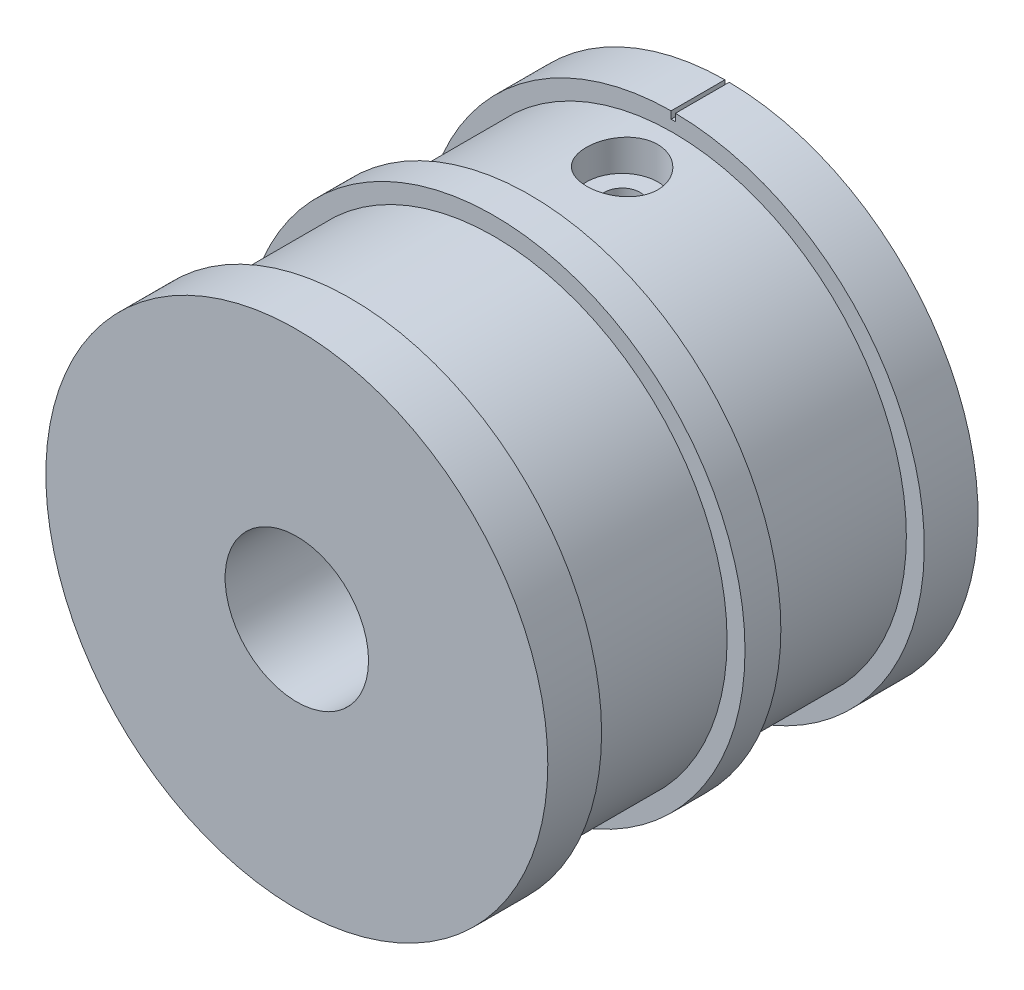
ISO-10303-21;
HEADER;
FILE_DESCRIPTION(('STEP AP214'),'2;1');
FILE_NAME('part.step','',(''),(''),'','','');
FILE_SCHEMA(('AUTOMOTIVE_DESIGN { 1 0 10303 214 1 1 1 1 }'));
ENDSEC;
DATA;
#1=APPLICATION_CONTEXT('core data for automotive mechanical design processes');
#2=APPLICATION_PROTOCOL_DEFINITION('international standard','automotive_design',2000,#1);
#3=PRODUCT_CONTEXT('',#1,'mechanical');
#4=PRODUCT('Part','Part','',(#3));
#5=PRODUCT_RELATED_PRODUCT_CATEGORY('part','',(#4));
#6=PRODUCT_DEFINITION_FORMATION('','',#4);
#7=PRODUCT_DEFINITION_CONTEXT('part definition',#1,'design');
#8=PRODUCT_DEFINITION('design','',#6,#7);
#9=PRODUCT_DEFINITION_SHAPE('','',#8);
#10=(LENGTH_UNIT() NAMED_UNIT(*) SI_UNIT(.MILLI.,.METRE.));
#11=(NAMED_UNIT(*) PLANE_ANGLE_UNIT() SI_UNIT($,.RADIAN.));
#12=(NAMED_UNIT(*) SI_UNIT($,.STERADIAN.) SOLID_ANGLE_UNIT());
#13=UNCERTAINTY_MEASURE_WITH_UNIT(LENGTH_MEASURE(1.E-05),#10,'distance_accuracy_value','');
#14=(GEOMETRIC_REPRESENTATION_CONTEXT(3) GLOBAL_UNCERTAINTY_ASSIGNED_CONTEXT((#13)) GLOBAL_UNIT_ASSIGNED_CONTEXT((#10,
#11,#12)) REPRESENTATION_CONTEXT('',''));
#15=CARTESIAN_POINT('',(0.,0.,0.));
#16=DIRECTION('',(0.,0.,1.));
#17=DIRECTION('',(1.,0.,0.));
#18=AXIS2_PLACEMENT_3D('',#15,#16,#17);
#19=CARTESIAN_POINT('',(0.,0.,27.5));
#20=DIRECTION('',(0.,0.,-1.));
#21=DIRECTION('',(-1.,0.,0.));
#22=AXIS2_PLACEMENT_3D('',#19,#20,#21);
#23=CYLINDRICAL_SURFACE('',#22,32.5);
#24=CARTESIAN_POINT('',(0.,0.,7.5));
#25=DIRECTION('',(0.,0.,1.));
#26=DIRECTION('',(1.,0.,0.));
#27=AXIS2_PLACEMENT_3D('',#24,#25,#26);
#28=CIRCLE('',#27,32.5);
#29=CARTESIAN_POINT('',(32.5,0.,7.5));
#30=VERTEX_POINT('',#29);
#31=EDGE_CURVE('E145',#30,#30,#28,.T.);
#32=ORIENTED_EDGE('',*,*,#31,.T.);
#33=EDGE_LOOP('',(#32));
#34=FACE_BOUND('',#33,.T.);
#35=CARTESIAN_POINT('',(0.,0.,27.5));
#36=DIRECTION('',(0.,0.,1.));
#37=DIRECTION('',(1.,0.,0.));
#38=AXIS2_PLACEMENT_3D('',#35,#36,#37);
#39=CIRCLE('',#38,32.5);
#40=CARTESIAN_POINT('',(32.5,0.,27.5));
#41=VERTEX_POINT('',#40);
#42=EDGE_CURVE('E148',#41,#41,#39,.T.);
#43=ORIENTED_EDGE('',*,*,#42,.F.);
#44=EDGE_LOOP('',(#43));
#45=FACE_BOUND('',#44,.T.);
#46=CARTESIAN_POINT('',(5.3662859612399,32.0539073278469,15.));
#47=CARTESIAN_POINT('',(5.3662879328032,32.0539064748225,14.8605836295942));
#48=CARTESIAN_POINT('',(5.36045293712174,32.0548853571854,14.7211944761494));
#49=CARTESIAN_POINT('',(5.33716061650461,32.0587720354693,14.4433743257646));
#50=CARTESIAN_POINT('',(5.31970087346708,32.0616802327129,14.3049435342313));
#51=CARTESIAN_POINT('',(5.27327373309989,32.0693488326322,14.029986220704));
#52=CARTESIAN_POINT('',(5.2442986163395,32.0741104777387,13.8934610398315));
#53=CARTESIAN_POINT('',(5.17505041226576,32.0853562113026,13.6233254578337));
#54=CARTESIAN_POINT('',(5.13477317409162,32.0918409325372,13.4897161470691));
#55=CARTESIAN_POINT('',(5.04328400598662,32.1063455842766,13.2265651872142));
#56=CARTESIAN_POINT('',(4.9920854181266,32.1143636403562,13.0970187941831));
#57=CARTESIAN_POINT('',(4.87908080684477,32.1317263368553,12.8426740527588));
#58=CARTESIAN_POINT('',(4.81727087445043,32.1410714659176,12.7178774748582));
#59=CARTESIAN_POINT('',(4.68353655572618,32.1608309801898,12.473999597601));
#60=CARTESIAN_POINT('',(4.61161732208519,32.171244819955,12.3549154278598));
#61=CARTESIAN_POINT('',(4.45811997661729,32.1928745737956,12.1231579615803));
#62=CARTESIAN_POINT('',(4.37653827408208,32.2040907854266,12.0104870714806));
#63=CARTESIAN_POINT('',(4.20359599727637,32.2271228951206,11.7914675530978));
#64=CARTESIAN_POINT('',(4.11216072696452,32.2389429561804,11.6851783383647));
#65=CARTESIAN_POINT('',(3.92066821054321,32.2627908132397,11.4806247433878));
#66=CARTESIAN_POINT('',(3.82060778640144,32.2748186844927,11.3823633472804));
#67=CARTESIAN_POINT('',(3.61261354615357,32.2987612121825,11.1946118322577));
#68=CARTESIAN_POINT('',(3.50468212395498,32.3106759018068,11.1051190656731));
#69=CARTESIAN_POINT('',(3.28161709582668,32.3340929731804,10.9354597359706));
#70=CARTESIAN_POINT('',(3.16648084643119,32.3455952011329,10.8552966271405));
#71=CARTESIAN_POINT('',(2.92908428260734,32.3679589143641,10.7044246673678));
#72=CARTESIAN_POINT('',(2.80678367736269,32.3788159093534,10.6337785211281));
#73=CARTESIAN_POINT('',(2.55653443723268,32.3995355578367,10.503028504012));
#74=CARTESIAN_POINT('',(2.42858371529857,32.409397839409,10.4429285701793));
#75=CARTESIAN_POINT('',(2.16801834935343,32.4278696037513,10.3337709862036));
#76=CARTESIAN_POINT('',(2.03540563779682,32.4364795981816,10.2847088217368));
#77=CARTESIAN_POINT('',(1.76641370923948,32.4522418385894,10.1979533008431));
#78=CARTESIAN_POINT('',(1.6300331341666,32.4593935509567,10.1602641035666));
#79=CARTESIAN_POINT('',(1.21888989713756,32.4782814762292,10.0652682208474));
#80=CARTESIAN_POINT('',(0.939836613008069,32.4876168519155,10.0250776894591));
#81=CARTESIAN_POINT('',(0.378955733872136,32.4990032073553,9.99211981826446));
#82=CARTESIAN_POINT('',(0.0971283218655964,32.5010546644177,9.99934937097198));
#83=CARTESIAN_POINT('',(-0.458608061172745,32.4979402519011,10.0606778364049));
#84=CARTESIAN_POINT('',(-0.732567209218188,32.4928438631973,10.1143236247401));
#85=CARTESIAN_POINT('',(-1.26758053722272,32.4763750716518,10.2663082457048));
#86=CARTESIAN_POINT('',(-1.52863448965228,32.4650025581998,10.3646478660129));
#87=CARTESIAN_POINT('',(-2.0311951595473,32.4374443413408,10.6034481712829));
#88=CARTESIAN_POINT('',(-2.27265330498906,32.4212471163298,10.7440096906682));
#89=CARTESIAN_POINT('',(-2.72871868770078,32.3860540019005,11.0631954761078));
#90=CARTESIAN_POINT('',(-2.94332419355988,32.3670579321893,11.2418221945337));
#91=CARTESIAN_POINT('',(-3.34180938209618,32.32836000009,11.6341468597062));
#92=CARTESIAN_POINT('',(-3.52536609033897,32.308653033404,11.8481724789913));
#93=CARTESIAN_POINT('',(-3.85403415480962,32.2710996146477,12.3041008215427));
#94=CARTESIAN_POINT('',(-3.99914505137322,32.2532531848237,12.5460038780664));
#95=CARTESIAN_POINT('',(-4.24700566294507,32.2215558396547,13.0514354971184));
#96=CARTESIAN_POINT('',(-4.34967627047253,32.2077124000651,13.3150033561713));
#97=CARTESIAN_POINT('',(-4.50921170071174,32.1857663385186,13.8558806847902));
#98=CARTESIAN_POINT('',(-4.56607942601792,32.1776633527849,14.1331892824033));
#99=CARTESIAN_POINT('',(-4.63199633355793,32.1682409620677,14.6911226392365));
#100=CARTESIAN_POINT('',(-4.64145267939437,32.1668637991366,14.9716983472674));
#101=CARTESIAN_POINT('',(-4.61336079255291,32.17090448499,15.5304301058109));
#102=CARTESIAN_POINT('',(-4.57581389166097,32.1763221412507,15.8085862246551));
#103=CARTESIAN_POINT('',(-4.45514203160366,32.1932501399256,16.3532476380123));
#104=CARTESIAN_POINT('',(-4.37223194203045,32.2047317506729,16.6198015121653));
#105=CARTESIAN_POINT('',(-4.16340645098651,32.2323916900542,17.1352321159905));
#106=CARTESIAN_POINT('',(-4.03748900996836,32.2485702414268,17.3841080066392));
#107=CARTESIAN_POINT('',(-3.74519777987764,32.2838230680492,17.8590182368287));
#108=CARTESIAN_POINT('',(-3.5785489419995,32.302916684308,18.0848818339076));
#109=CARTESIAN_POINT('',(-3.20989486194158,32.3416270201408,18.5055902617345));
#110=CARTESIAN_POINT('',(-3.00788785157578,32.3612437658338,18.7004335402923));
#111=CARTESIAN_POINT('',(-2.5724930956284,32.3987697433947,19.0549923086484));
#112=CARTESIAN_POINT('',(-2.33888982352744,32.416665660228,19.2144447013894));
#113=CARTESIAN_POINT('',(-1.84794853966959,32.4483509862999,19.4918405249862));
#114=CARTESIAN_POINT('',(-1.59061134805959,32.4621405373682,19.6097853894942));
#115=CARTESIAN_POINT('',(-1.06077120361871,32.4837613499395,19.8002546394729));
#116=CARTESIAN_POINT('',(-0.788343042687934,32.4916195894212,19.8729844114481));
#117=CARTESIAN_POINT('',(-0.234886788071315,32.5003260711631,19.9716669394217));
#118=CARTESIAN_POINT('',(0.0461407455630646,32.5011747689626,19.9976227351035));
#119=CARTESIAN_POINT('',(0.466278775728521,32.4969565147842,20.0009480102994));
#120=CARTESIAN_POINT('',(0.605500151301694,32.4946565343604,19.9962165324269));
#121=CARTESIAN_POINT('',(0.883010239912882,32.4882976679932,19.9751703850544));
#122=CARTESIAN_POINT('',(1.02129928088146,32.4842394372036,19.9588600285961));
#123=CARTESIAN_POINT('',(1.29601730343148,32.4744400742266,19.9147707305297));
#124=CARTESIAN_POINT('',(1.43244558980046,32.4686983301481,19.8869876175221));
#125=CARTESIAN_POINT('',(1.70239532547462,32.4556636031166,19.8201800276335));
#126=CARTESIAN_POINT('',(1.83591780045062,32.4483711776318,19.7811595887774));
#127=CARTESIAN_POINT('',(2.0993223321463,32.4323955034781,19.692114204543));
#128=CARTESIAN_POINT('',(2.22920012240967,32.4237106986663,19.64207692295));
#129=CARTESIAN_POINT('',(2.48421833563493,32.4051693351625,19.5314099202732));
#130=CARTESIAN_POINT('',(2.60936043602656,32.3953131965891,19.470783993343));
#131=CARTESIAN_POINT('',(2.85415119373218,32.3746647307139,19.3393357271378));
#132=CARTESIAN_POINT('',(2.97379769545135,32.3638720407744,19.2685094311609));
#133=CARTESIAN_POINT('',(3.20669497340303,32.3416262601479,19.1172021989498));
#134=CARTESIAN_POINT('',(3.31994799377612,32.330173404071,19.0367246817182));
#135=CARTESIAN_POINT('',(3.54056430233337,32.3067616453931,18.8657021070904));
#136=CARTESIAN_POINT('',(3.64784808059732,32.294798531396,18.7750550383675));
#137=CARTESIAN_POINT('',(3.85437110156418,32.2708014994489,18.5850995783381));
#138=CARTESIAN_POINT('',(3.95361321975837,32.2587676084726,18.4857943095857));
#139=CARTESIAN_POINT('',(4.14346878683852,32.2349317968785,18.2791145019037));
#140=CARTESIAN_POINT('',(4.23407700721015,32.2231300202144,18.1717351429981));
#141=CARTESIAN_POINT('',(4.40593231771515,32.2000819368557,17.9497380235689));
#142=CARTESIAN_POINT('',(4.48718286822325,32.1888354257141,17.8351229631672));
#143=CARTESIAN_POINT('',(4.64022361718994,32.1671312835061,17.5987295650839));
#144=CARTESIAN_POINT('',(4.71195695651758,32.1566785405317,17.4769139541883));
#145=CARTESIAN_POINT('',(4.8448628180404,32.136922974687,17.2276210756636));
#146=CARTESIAN_POINT('',(4.90603924599172,32.1276197268995,17.1001459239439));
#147=CARTESIAN_POINT('',(5.01736693986225,32.1104220370417,16.840484172791));
#148=CARTESIAN_POINT('',(5.06752632962764,32.1025265577119,16.7083011290639));
#149=CARTESIAN_POINT('',(5.15648353600301,32.0883577037767,16.4401279663094));
#150=CARTESIAN_POINT('',(5.19528390638233,32.0820839646038,16.3041387105503));
#151=CARTESIAN_POINT('',(5.27402678016939,32.0692505880934,15.9759719144594));
#152=CARTESIAN_POINT('',(5.30858424943259,32.0635224424817,15.7824435894272));
#153=CARTESIAN_POINT('',(5.35471226762249,32.055851443192,15.3925921660993));
#154=CARTESIAN_POINT('',(5.36628318569082,32.0539085287271,15.1962691127352));
#155=CARTESIAN_POINT('',(5.3662859612399,32.0539073278469,15.));
#156=B_SPLINE_CURVE_WITH_KNOTS('',3,(#46,#47,#48,#49,#50,#51,#52,#53,#54,#55,#56,#57,#58,#59,
#60,#61,#62,#63,#64,#65,#66,#67,#68,#69,#70,#71,#72,#73,#74,#75,#76,#77,#78,#79,#80,#81,#82,#83,
#84,#85,#86,#87,#88,#89,#90,#91,#92,#93,#94,#95,#96,#97,#98,#99,#100,#101,#102,#103,#104,#105,
#106,#107,#108,#109,#110,#111,#112,#113,#114,#115,#116,#117,#118,#119,#120,#121,#122,#123,#124,
#125,#126,#127,#128,#129,#130,#131,#132,#133,#134,#135,#136,#137,#138,#139,#140,#141,#142,#143,
#144,#145,#146,#147,#148,#149,#150,#151,#152,#153,#154,#155),.UNSPECIFIED.,.T.,.F.,(4,2,2,2,2,2,
2,2,2,2,2,2,2,2,2,2,2,2,2,2,2,2,2,2,2,2,2,2,2,2,2,2,2,2,2,2,2,2,2,2,2,2,2,2,2,2,2,2,2,2,2,2,2,2,
4),(0.,0.418076861563013,0.83624071584756,1.25468536401717,1.67328389337777,2.09137394079005,
2.5096183346324,2.92765031804596,3.34583813829231,3.7674548433623,4.18922756725293,
4.61087254273986,5.03267313813962,5.45712951345278,5.88174400851821,6.30618452402391,
6.73078007193171,7.57260873427203,8.41438223127783,9.24802971616431,10.0816918937238,
10.917361071787,11.75308410459,12.5970271374685,13.4409802602092,14.2864994699528,
15.131965093713,15.9701573653634,16.8083258882832,17.6425582435206,18.4768301662432,
19.3168994018804,20.1570106595786,21.0031724081856,21.8493049278617,22.6915653136322,
23.5337709617604,23.9513273859866,24.368728355265,24.7862812219,25.2036842317499,
25.6215570314329,26.039280403791,26.4571662487865,26.8749044901266,27.2972885701086,
27.7195209437055,28.1420074089879,28.564337137846,28.9890861504296,29.413677679501,
29.8379550602914,30.2621369803656,30.8507112790627,31.4392761257535),.UNSPECIFIED.);
#157=CARTESIAN_POINT('',(5.3662859612399,32.0539073278469,15.));
#158=VERTEX_POINT('',#157);
#159=EDGE_CURVE('E53',#158,#158,#156,.T.);
#160=ORIENTED_EDGE('',*,*,#159,.F.);
#161=EDGE_LOOP('',(#160));
#162=FACE_BOUND('',#161,.T.);
#163=ADVANCED_FACE('F49',(#34,#45,#162),#23,.T.);
#164=CARTESIAN_POINT('',(0.,0.,32.5));
#165=DIRECTION('',(0.,0.,1.));
#166=DIRECTION('',(1.,0.,0.));
#167=AXIS2_PLACEMENT_3D('',#164,#165,#166);
#168=PLANE('',#167);
#169=CARTESIAN_POINT('',(0.,0.,32.5));
#170=DIRECTION('',(0.,0.,1.));
#171=DIRECTION('',(1.,0.,0.));
#172=AXIS2_PLACEMENT_3D('',#169,#170,#171);
#173=CIRCLE('',#172,35.);
#174=CARTESIAN_POINT('',(35.,0.,32.5));
#175=VERTEX_POINT('',#174);
#176=EDGE_CURVE('E142',#175,#175,#173,.T.);
#177=ORIENTED_EDGE('',*,*,#176,.T.);
#178=EDGE_LOOP('',(#177));
#179=FACE_BOUND('',#178,.T.);
#180=CARTESIAN_POINT('',(0.,0.,32.5));
#181=DIRECTION('',(0.,0.,1.));
#182=DIRECTION('',(1.,0.,0.));
#183=AXIS2_PLACEMENT_3D('',#180,#181,#182);
#184=CIRCLE('',#183,32.5);
#185=CARTESIAN_POINT('',(32.5,0.,32.5));
#186=VERTEX_POINT('',#185);
#187=EDGE_CURVE('E133',#186,#186,#184,.T.);
#188=ORIENTED_EDGE('',*,*,#187,.F.);
#189=EDGE_LOOP('',(#188));
#190=FACE_BOUND('',#189,.T.);
#191=ADVANCED_FACE('F193',(#179,#190),#168,.T.);
#192=CARTESIAN_POINT('',(0.,0.,7.5));
#193=DIRECTION('',(0.,0.,1.));
#194=DIRECTION('',(1.,0.,0.));
#195=AXIS2_PLACEMENT_3D('',#192,#193,#194);
#196=PLANE('',#195);
#197=DIRECTION('',(0.,-1.,0.));
#198=VECTOR('',#197,1.);
#199=CARTESIAN_POINT('',(0.3,36.201425089436,7.5));
#200=LINE('',#199,#198);
#201=CARTESIAN_POINT('',(0.3,34.9987142620983,7.5));
#202=VERTEX_POINT('',#201);
#203=CARTESIAN_POINT('',(0.299999999999999,33.9853761560648,7.5));
#204=VERTEX_POINT('',#203);
#205=EDGE_CURVE('E96',#202,#204,#200,.T.);
#206=ORIENTED_EDGE('',*,*,#205,.T.);
#207=DIRECTION('',(-1.,0.,0.));
#208=VECTOR('',#207,1.);
#209=CARTESIAN_POINT('',(0.299999999999999,33.9853761560648,7.5));
#210=LINE('',#209,#208);
#211=CARTESIAN_POINT('',(-0.3,33.9853761560648,7.5));
#212=VERTEX_POINT('',#211);
#213=EDGE_CURVE('E106',#204,#212,#210,.T.);
#214=ORIENTED_EDGE('',*,*,#213,.T.);
#215=DIRECTION('',(0.,1.,0.));
#216=VECTOR('',#215,1.);
#217=CARTESIAN_POINT('',(-0.3,36.201425089436,7.5));
#218=LINE('',#217,#216);
#219=CARTESIAN_POINT('',(-0.3,34.9987142620983,7.5));
#220=VERTEX_POINT('',#219);
#221=EDGE_CURVE('E103',#212,#220,#218,.T.);
#222=ORIENTED_EDGE('',*,*,#221,.T.);
#223=CARTESIAN_POINT('',(0.,0.,7.5));
#224=DIRECTION('',(0.,0.,1.));
#225=DIRECTION('',(1.,0.,0.));
#226=AXIS2_PLACEMENT_3D('',#223,#224,#225);
#227=CIRCLE('',#226,35.);
#228=EDGE_CURVE('E114',#220,#202,#227,.T.);
#229=ORIENTED_EDGE('',*,*,#228,.T.);
#230=EDGE_LOOP('',(#206,#214,#222,#229));
#231=FACE_BOUND('',#230,.T.);
#232=ORIENTED_EDGE('',*,*,#31,.F.);
#233=EDGE_LOOP('',(#232));
#234=FACE_BOUND('',#233,.T.);
#235=ADVANCED_FACE('F111',(#231,#234),#196,.T.);
#236=CARTESIAN_POINT('',(0.,0.,0.));
#237=DIRECTION('',(0.,0.,1.));
#238=DIRECTION('',(1.,0.,0.));
#239=AXIS2_PLACEMENT_3D('',#236,#237,#238);
#240=PLANE('',#239);
#241=DIRECTION('',(-1.,0.,0.));
#242=VECTOR('',#241,1.);
#243=CARTESIAN_POINT('',(0.299999999999999,33.9853761560648,0.));
#244=LINE('',#243,#242);
#245=CARTESIAN_POINT('',(0.299999999999999,33.9853761560648,0.));
#246=VERTEX_POINT('',#245);
#247=CARTESIAN_POINT('',(-0.3,33.9853761560648,0.));
#248=VERTEX_POINT('',#247);
#249=EDGE_CURVE('E116',#246,#248,#244,.T.);
#250=ORIENTED_EDGE('',*,*,#249,.F.);
#251=DIRECTION('',(0.,-1.,0.));
#252=VECTOR('',#251,1.);
#253=CARTESIAN_POINT('',(0.3,36.201425089436,0.));
#254=LINE('',#253,#252);
#255=CARTESIAN_POINT('',(0.3,34.9987142620983,0.));
#256=VERTEX_POINT('',#255);
#257=EDGE_CURVE('E98',#256,#246,#254,.T.);
#258=ORIENTED_EDGE('',*,*,#257,.F.);
#259=CARTESIAN_POINT('',(0.,0.,0.));
#260=DIRECTION('',(0.,0.,1.));
#261=DIRECTION('',(1.,0.,0.));
#262=AXIS2_PLACEMENT_3D('',#259,#260,#261);
#263=CIRCLE('',#262,35.);
#264=CARTESIAN_POINT('',(-0.3,34.9987142620983,0.));
#265=VERTEX_POINT('',#264);
#266=EDGE_CURVE('E156',#265,#256,#263,.T.);
#267=ORIENTED_EDGE('',*,*,#266,.F.);
#268=DIRECTION('',(0.,1.,0.));
#269=VECTOR('',#268,1.);
#270=CARTESIAN_POINT('',(-0.3,36.201425089436,0.));
#271=LINE('',#270,#269);
#272=EDGE_CURVE('E69',#248,#265,#271,.T.);
#273=ORIENTED_EDGE('',*,*,#272,.F.);
#274=EDGE_LOOP('',(#250,#258,#267,#273));
#275=FACE_BOUND('',#274,.T.);
#276=CARTESIAN_POINT('',(0.,0.,0.));
#277=DIRECTION('',(0.,0.,1.));
#278=DIRECTION('',(1.,0.,0.));
#279=AXIS2_PLACEMENT_3D('',#276,#277,#278);
#280=CIRCLE('',#279,10.);
#281=CARTESIAN_POINT('',(10.,0.,0.));
#282=VERTEX_POINT('',#281);
#283=EDGE_CURVE('E151',#282,#282,#280,.T.);
#284=ORIENTED_EDGE('',*,*,#283,.T.);
#285=EDGE_LOOP('',(#284));
#286=FACE_BOUND('',#285,.T.);
#287=ADVANCED_FACE('F163',(#275,#286),#240,.F.);
#288=CARTESIAN_POINT('',(0.,0.,7.5));
#289=DIRECTION('',(0.,0.,-1.));
#290=DIRECTION('',(-1.,0.,0.));
#291=AXIS2_PLACEMENT_3D('',#288,#289,#290);
#292=CYLINDRICAL_SURFACE('',#291,35.);
#293=ORIENTED_EDGE('',*,*,#266,.T.);
#294=DIRECTION('',(0.,0.,-1.));
#295=VECTOR('',#294,1.);
#296=CARTESIAN_POINT('',(0.3,34.9987142620983,7.5));
#297=LINE('',#296,#295);
#298=EDGE_CURVE('E14',#256,#202,#297,.F.);
#299=ORIENTED_EDGE('',*,*,#298,.T.);
#300=ORIENTED_EDGE('',*,*,#228,.F.);
#301=DIRECTION('',(0.,0.,-1.));
#302=VECTOR('',#301,1.);
#303=CARTESIAN_POINT('',(-0.3,34.9987142620983,7.5));
#304=LINE('',#303,#302);
#305=EDGE_CURVE('E62',#220,#265,#304,.T.);
#306=ORIENTED_EDGE('',*,*,#305,.T.);
#307=EDGE_LOOP('',(#293,#299,#300,#306));
#308=FACE_BOUND('',#307,.T.);
#309=ADVANCED_FACE('F51',(#308),#292,.T.);
#310=CARTESIAN_POINT('',(0.,0.,7.5));
#311=DIRECTION('',(0.,0.,-1.));
#312=DIRECTION('',(-1.,0.,0.));
#313=AXIS2_PLACEMENT_3D('',#310,#311,#312);
#314=CYLINDRICAL_SURFACE('',#313,10.);
#315=CARTESIAN_POINT('',(2.8662859612399,9.5804177773414,15.));
#316=CARTESIAN_POINT('',(2.86628199543044,9.58042058669403,14.8628602433715));
#317=CARTESIAN_POINT('',(2.85496110295683,9.58382827480948,14.7256774756913));
#318=CARTESIAN_POINT('',(2.8100713917288,9.59708428978654,14.4552787356741));
#319=CARTESIAN_POINT('',(2.77648936036816,9.60693644157094,14.3220651682642));
#320=CARTESIAN_POINT('',(2.68829834767788,9.63198492535715,14.0635823913685));
#321=CARTESIAN_POINT('',(2.63372259645969,9.64717280836756,13.9383009895178));
#322=CARTESIAN_POINT('',(2.50522273856254,9.68133569185828,13.6986769305076));
#323=CARTESIAN_POINT('',(2.43129730715737,9.7003109516105,13.5843350230247));
#324=CARTESIAN_POINT('',(2.26399950742092,9.74073304189747,13.3665957214488));
#325=CARTESIAN_POINT('',(2.1701790462517,9.76223058433383,13.2635520479346));
#326=CARTESIAN_POINT('',(1.96674867522037,9.80523805689842,13.0744318959622));
#327=CARTESIAN_POINT('',(1.85713647785548,9.82674798837089,12.9883578799196));
#328=CARTESIAN_POINT('',(1.62218298542411,9.86828545747564,12.8336775464926));
#329=CARTESIAN_POINT('',(1.4965365921157,9.88826721669756,12.7655211582046));
#330=CARTESIAN_POINT('',(1.23499646478957,9.92432290091585,12.6514498886849));
#331=CARTESIAN_POINT('',(1.09910400196628,9.94039730964189,12.6055322535982));
#332=CARTESIAN_POINT('',(0.823492426254445,9.96697895429885,12.5381472766221));
#333=CARTESIAN_POINT('',(0.68388767307286,9.97758201875699,12.5162509242458));
#334=CARTESIAN_POINT('',(0.40267288345268,9.99288082422336,12.4962956122815));
#335=CARTESIAN_POINT('',(0.261063234640358,9.99757769177927,12.4982321060573));
#336=CARTESIAN_POINT('',(-0.015859843974168,10.0009195078144,12.5255758105965));
#337=CARTESIAN_POINT('',(-0.151237834552256,9.99973265873467,12.5503144172667));
#338=CARTESIAN_POINT('',(-0.41597351872204,9.99222250536834,12.6215841508971));
#339=CARTESIAN_POINT('',(-0.545331152237686,9.98589914983705,12.6681154952717));
#340=CARTESIAN_POINT('',(-0.794563713628997,9.96916741955297,12.7816228166708));
#341=CARTESIAN_POINT('',(-0.914430908411916,9.95875575386122,12.8486152544447));
#342=CARTESIAN_POINT('',(-1.14144268506143,9.93529822660064,13.0011351619448));
#343=CARTESIAN_POINT('',(-1.24858542776677,9.92225198497073,13.086665306031));
#344=CARTESIAN_POINT('',(-1.44978004087632,9.89488277916894,13.2762095956384));
#345=CARTESIAN_POINT('',(-1.54346187316667,9.88053689899309,13.3806134555388));
#346=CARTESIAN_POINT('',(-1.71213459536752,9.85271148144435,13.6036755362364));
#347=CARTESIAN_POINT('',(-1.78712425921878,9.83923200094347,13.7223346913127));
#348=CARTESIAN_POINT('',(-1.91690680541344,9.81477915780382,13.971899594192));
#349=CARTESIAN_POINT('',(-1.97150589219669,9.8038302014631,14.1029087304321));
#350=CARTESIAN_POINT('',(-2.05782228819981,9.78607828370361,14.3725233267702));
#351=CARTESIAN_POINT('',(-2.08954297127995,9.77927471099135,14.511127663565));
#352=CARTESIAN_POINT('',(-2.12870885133764,9.77082379297959,14.7893362787379));
#353=CARTESIAN_POINT('',(-2.13657981659994,9.76908603376843,14.9288778865168));
#354=CARTESIAN_POINT('',(-2.12899382152866,9.77074205180709,15.2072872900829));
#355=CARTESIAN_POINT('',(-2.11353852261163,9.77413546358853,15.3461551331524));
#356=CARTESIAN_POINT('',(-2.06015945339856,9.78552316600089,15.6174416251103));
#357=CARTESIAN_POINT('',(-2.02252526525255,9.79345812144861,15.7499200023222));
#358=CARTESIAN_POINT('',(-1.92617382921764,9.81286166280028,16.0066965371688));
#359=CARTESIAN_POINT('',(-1.86745445973784,9.82433060427743,16.1309938701371));
#360=CARTESIAN_POINT('',(-1.72957759865497,9.84954448133757,16.3699126675766));
#361=CARTESIAN_POINT('',(-1.65012995363441,9.86332064447108,16.484363323674));
#362=CARTESIAN_POINT('',(-1.47338653211274,9.89126476663195,16.698494227151));
#363=CARTESIAN_POINT('',(-1.37608864412775,9.90543277184128,16.7981727246251));
#364=CARTESIAN_POINT('',(-1.16442136997048,9.93255632158977,16.981634139179));
#365=CARTESIAN_POINT('',(-1.04979285833654,9.94548752422838,17.065122176067));
#366=CARTESIAN_POINT('',(-0.807841598521299,9.96805546126774,17.211655923546));
#367=CARTESIAN_POINT('',(-0.680519970126685,9.97769248594924,17.274703435317));
#368=CARTESIAN_POINT('',(-0.418286119431749,9.99210039571466,17.377828905351));
#369=CARTESIAN_POINT('',(-0.283475777800789,9.99692497067431,17.4181580587202));
#370=CARTESIAN_POINT('',(-0.00893005529184869,10.0009373860229,17.4756564660465));
#371=CARTESIAN_POINT('',(0.130804506309454,10.0001261597151,17.4928295541455));
#372=CARTESIAN_POINT('',(0.407770655275773,9.99262119596429,17.5034065748221));
#373=CARTESIAN_POINT('',(0.544985754478721,9.98606339177852,17.4973489144325));
#374=CARTESIAN_POINT('',(0.816217708531151,9.96756096904966,17.4629759122717));
#375=CARTESIAN_POINT('',(0.950234521191654,9.95561627948882,17.4346602770599));
#376=CARTESIAN_POINT('',(1.21175902735695,9.92718493388796,17.3566604141526));
#377=CARTESIAN_POINT('',(1.3392486497946,9.91068639951133,17.3069201090819));
#378=CARTESIAN_POINT('',(1.58407984527501,9.87451389059052,17.1875860531312));
#379=CARTESIAN_POINT('',(1.70141977979073,9.85483940479678,17.1179891044364));
#380=CARTESIAN_POINT('',(1.92633809813281,9.81339347022368,16.9585184839758));
#381=CARTESIAN_POINT('',(2.03352916865354,9.79157743876626,16.8681099029217));
#382=CARTESIAN_POINT('',(2.23139777598128,9.74839180812153,16.6706000314088));
#383=CARTESIAN_POINT('',(2.32207095629882,9.72702232802115,16.5634943509779));
#384=CARTESIAN_POINT('',(2.48580124322292,9.68648759376757,16.3333889987731));
#385=CARTESIAN_POINT('',(2.55853730492873,9.66736533168594,16.2101528331256));
#386=CARTESIAN_POINT('',(2.68207819589062,9.63382502327734,15.9526100167297));
#387=CARTESIAN_POINT('',(2.7329009828822,9.61940312741689,15.8183125385466));
#388=CARTESIAN_POINT('',(2.80310962056297,9.59914674049649,15.5701349471046));
#389=CARTESIAN_POINT('',(2.82674623862018,9.59217258550238,15.4575321738951));
#390=CARTESIAN_POINT('',(2.85833520992058,9.58280717786174,15.2299628406371));
#391=CARTESIAN_POINT('',(2.86628928671154,9.58041542159974,15.1149965417491));
#392=CARTESIAN_POINT('',(2.8662859612399,9.5804177773414,15.));
#393=B_SPLINE_CURVE_WITH_KNOTS('',3,(#315,#316,#317,#318,#319,#320,#321,#322,#323,#324,#325,
#326,#327,#328,#329,#330,#331,#332,#333,#334,#335,#336,#337,#338,#339,#340,#341,#342,#343,#344,
#345,#346,#347,#348,#349,#350,#351,#352,#353,#354,#355,#356,#357,#358,#359,#360,#361,#362,#363,
#364,#365,#366,#367,#368,#369,#370,#371,#372,#373,#374,#375,#376,#377,#378,#379,#380,#381,#382,
#383,#384,#385,#386,#387,#388,#389,#390,#391,#392),.UNSPECIFIED.,.T.,.F.,(4,2,2,2,2,2,2,2,2,2,2,
2,2,2,2,2,2,2,2,2,2,2,2,2,2,2,2,2,2,2,2,2,2,2,2,2,2,2,4),(0.,0.41099388983527,0.822231934670365,
1.23282170823106,1.64343959912265,2.06453521297937,2.48569188584157,2.91658700444526,
3.34742875106973,3.77044383705008,4.19337822491023,4.6042927776966,5.01521143004588,
5.42646153709024,5.83777101306518,6.25881954520907,6.67989568756182,7.10487768912504,
7.52979700610402,7.94708454388446,8.36434236170187,8.77626925256952,9.18823760313946,
9.60631478668175,10.0244414559978,10.4495861604881,10.8746933918489,11.2950030341283,
11.715243073704,12.1258029430646,12.5363682251796,12.9480147225466,13.359727551012,
13.7835175362215,14.2074191320561,14.6384320829311,15.0690911480506,15.4137619592999,
15.7583948883132),.UNSPECIFIED.);
#394=CARTESIAN_POINT('',(2.8662859612399,9.5804177773414,15.));
#395=VERTEX_POINT('',#394);
#396=EDGE_CURVE('E324',#395,#395,#393,.T.);
#397=ORIENTED_EDGE('',*,*,#396,.T.);
#398=EDGE_LOOP('',(#397));
#399=FACE_BOUND('',#398,.T.);
#400=ORIENTED_EDGE('',*,*,#283,.F.);
#401=EDGE_LOOP('',(#400));
#402=FACE_BOUND('',#401,.T.);
#403=CARTESIAN_POINT('',(0.,0.,60.));
#404=DIRECTION('',(0.,0.,1.));
#405=DIRECTION('',(1.,0.,0.));
#406=AXIS2_PLACEMENT_3D('',#403,#404,#405);
#407=CIRCLE('',#406,10.);
#408=CARTESIAN_POINT('',(10.,0.,60.));
#409=VERTEX_POINT('',#408);
#410=EDGE_CURVE('E125',#409,#409,#407,.T.);
#411=ORIENTED_EDGE('',*,*,#410,.T.);
#412=EDGE_LOOP('',(#411));
#413=FACE_BOUND('',#412,.T.);
#414=ADVANCED_FACE('F168',(#399,#402,#413),#314,.F.);
#415=CARTESIAN_POINT('',(0.,0.,27.5));
#416=DIRECTION('',(0.,0.,1.));
#417=DIRECTION('',(1.,0.,0.));
#418=AXIS2_PLACEMENT_3D('',#415,#416,#417);
#419=PLANE('',#418);
#420=CARTESIAN_POINT('',(0.,0.,27.5));
#421=DIRECTION('',(0.,0.,1.));
#422=DIRECTION('',(1.,0.,0.));
#423=AXIS2_PLACEMENT_3D('',#420,#421,#422);
#424=CIRCLE('',#423,35.);
#425=CARTESIAN_POINT('',(35.,0.,27.5));
#426=VERTEX_POINT('',#425);
#427=EDGE_CURVE('E139',#426,#426,#424,.T.);
#428=ORIENTED_EDGE('',*,*,#427,.F.);
#429=EDGE_LOOP('',(#428));
#430=FACE_BOUND('',#429,.T.);
#431=ORIENTED_EDGE('',*,*,#42,.T.);
#432=EDGE_LOOP('',(#431));
#433=FACE_BOUND('',#432,.T.);
#434=ADVANCED_FACE('F171',(#430,#433),#419,.F.);
#435=CARTESIAN_POINT('',(0.,0.,32.5));
#436=DIRECTION('',(0.,0.,-1.));
#437=DIRECTION('',(-1.,0.,0.));
#438=AXIS2_PLACEMENT_3D('',#435,#436,#437);
#439=CYLINDRICAL_SURFACE('',#438,35.);
#440=ORIENTED_EDGE('',*,*,#176,.F.);
#441=EDGE_LOOP('',(#440));
#442=FACE_BOUND('',#441,.T.);
#443=ORIENTED_EDGE('',*,*,#427,.T.);
#444=EDGE_LOOP('',(#443));
#445=FACE_BOUND('',#444,.T.);
#446=ADVANCED_FACE('F203',(#442,#445),#439,.T.);
#447=CARTESIAN_POINT('',(0.,0.,52.5));
#448=DIRECTION('',(0.,0.,-1.));
#449=DIRECTION('',(-1.,0.,0.));
#450=AXIS2_PLACEMENT_3D('',#447,#448,#449);
#451=CYLINDRICAL_SURFACE('',#450,32.5);
#452=CARTESIAN_POINT('',(0.,0.,52.5));
#453=DIRECTION('',(0.,0.,1.));
#454=DIRECTION('',(1.,0.,0.));
#455=AXIS2_PLACEMENT_3D('',#452,#453,#454);
#456=CIRCLE('',#455,32.5);
#457=CARTESIAN_POINT('',(32.5,0.,52.5));
#458=VERTEX_POINT('',#457);
#459=EDGE_CURVE('E136',#458,#458,#456,.T.);
#460=ORIENTED_EDGE('',*,*,#459,.F.);
#461=EDGE_LOOP('',(#460));
#462=FACE_BOUND('',#461,.T.);
#463=ORIENTED_EDGE('',*,*,#187,.T.);
#464=EDGE_LOOP('',(#463));
#465=FACE_BOUND('',#464,.T.);
#466=ADVANCED_FACE('F188',(#462,#465),#451,.T.);
#467=CARTESIAN_POINT('',(0.,0.,52.5));
#468=DIRECTION('',(0.,0.,1.));
#469=DIRECTION('',(1.,0.,0.));
#470=AXIS2_PLACEMENT_3D('',#467,#468,#469);
#471=PLANE('',#470);
#472=CARTESIAN_POINT('',(0.,0.,52.5));
#473=DIRECTION('',(0.,0.,1.));
#474=DIRECTION('',(1.,0.,0.));
#475=AXIS2_PLACEMENT_3D('',#472,#473,#474);
#476=CIRCLE('',#475,35.);
#477=CARTESIAN_POINT('',(35.,0.,52.5));
#478=VERTEX_POINT('',#477);
#479=EDGE_CURVE('E129',#478,#478,#476,.T.);
#480=ORIENTED_EDGE('',*,*,#479,.F.);
#481=EDGE_LOOP('',(#480));
#482=FACE_BOUND('',#481,.T.);
#483=ORIENTED_EDGE('',*,*,#459,.T.);
#484=EDGE_LOOP('',(#483));
#485=FACE_BOUND('',#484,.T.);
#486=ADVANCED_FACE('F179',(#482,#485),#471,.F.);
#487=CARTESIAN_POINT('',(0.,0.,60.));
#488=DIRECTION('',(0.,0.,1.));
#489=DIRECTION('',(1.,0.,0.));
#490=AXIS2_PLACEMENT_3D('',#487,#488,#489);
#491=PLANE('',#490);
#492=CARTESIAN_POINT('',(0.,0.,60.));
#493=DIRECTION('',(0.,0.,1.));
#494=DIRECTION('',(1.,0.,0.));
#495=AXIS2_PLACEMENT_3D('',#492,#493,#494);
#496=CIRCLE('',#495,35.);
#497=CARTESIAN_POINT('',(35.,0.,60.));
#498=VERTEX_POINT('',#497);
#499=EDGE_CURVE('E130',#498,#498,#496,.T.);
#500=ORIENTED_EDGE('',*,*,#499,.T.);
#501=EDGE_LOOP('',(#500));
#502=FACE_BOUND('',#501,.T.);
#503=ORIENTED_EDGE('',*,*,#410,.F.);
#504=EDGE_LOOP('',(#503));
#505=FACE_BOUND('',#504,.T.);
#506=ADVANCED_FACE('F176',(#502,#505),#491,.T.);
#507=CARTESIAN_POINT('',(0.,0.,60.));
#508=DIRECTION('',(0.,0.,-1.));
#509=DIRECTION('',(-1.,0.,0.));
#510=AXIS2_PLACEMENT_3D('',#507,#508,#509);
#511=CYLINDRICAL_SURFACE('',#510,35.);
#512=ORIENTED_EDGE('',*,*,#499,.F.);
#513=EDGE_LOOP('',(#512));
#514=FACE_BOUND('',#513,.T.);
#515=ORIENTED_EDGE('',*,*,#479,.T.);
#516=EDGE_LOOP('',(#515));
#517=FACE_BOUND('',#516,.T.);
#518=ADVANCED_FACE('F178',(#514,#517),#511,.T.);
#519=CARTESIAN_POINT('',(0.3,36.201425089436,7.5));
#520=DIRECTION('',(1.,0.,0.));
#521=DIRECTION('',(0.,1.,0.));
#522=AXIS2_PLACEMENT_3D('',#519,#520,#521);
#523=PLANE('',#522);
#524=ORIENTED_EDGE('',*,*,#257,.T.);
#525=DIRECTION('',(0.,0.,-1.));
#526=VECTOR('',#525,1.);
#527=CARTESIAN_POINT('',(0.299999999999999,33.9853761560648,7.5));
#528=LINE('',#527,#526);
#529=EDGE_CURVE('E92',#204,#246,#528,.T.);
#530=ORIENTED_EDGE('',*,*,#529,.F.);
#531=ORIENTED_EDGE('',*,*,#205,.F.);
#532=ORIENTED_EDGE('',*,*,#298,.F.);
#533=EDGE_LOOP('',(#524,#530,#531,#532));
#534=FACE_BOUND('',#533,.T.);
#535=ADVANCED_FACE('F94',(#534),#523,.F.);
#536=CARTESIAN_POINT('',(-0.3,36.201425089436,7.5));
#537=DIRECTION('',(-1.,0.,0.));
#538=DIRECTION('',(0.,-1.,0.));
#539=AXIS2_PLACEMENT_3D('',#536,#537,#538);
#540=PLANE('',#539);
#541=ORIENTED_EDGE('',*,*,#221,.F.);
#542=DIRECTION('',(0.,0.,-1.));
#543=VECTOR('',#542,1.);
#544=CARTESIAN_POINT('',(-0.3,33.9853761560648,7.5));
#545=LINE('',#544,#543);
#546=EDGE_CURVE('E102',#212,#248,#545,.T.);
#547=ORIENTED_EDGE('',*,*,#546,.T.);
#548=ORIENTED_EDGE('',*,*,#272,.T.);
#549=ORIENTED_EDGE('',*,*,#305,.F.);
#550=EDGE_LOOP('',(#541,#547,#548,#549));
#551=FACE_BOUND('',#550,.T.);
#552=ADVANCED_FACE('F268',(#551),#540,.F.);
#553=CARTESIAN_POINT('',(0.299999999999999,33.9853761560648,7.5));
#554=DIRECTION('',(0.,-1.,0.));
#555=DIRECTION('',(0.,0.,-1.));
#556=AXIS2_PLACEMENT_3D('',#553,#554,#555);
#557=PLANE('',#556);
#558=ORIENTED_EDGE('',*,*,#249,.T.);
#559=ORIENTED_EDGE('',*,*,#546,.F.);
#560=ORIENTED_EDGE('',*,*,#213,.F.);
#561=ORIENTED_EDGE('',*,*,#529,.T.);
#562=EDGE_LOOP('',(#558,#559,#560,#561));
#563=FACE_BOUND('',#562,.T.);
#564=ADVANCED_FACE('F107',(#563),#557,.F.);
#565=CARTESIAN_POINT('',(0.366285961239901,43.9853761560648,15.));
#566=DIRECTION('',(0.,-1.,0.));
#567=DIRECTION('',(1.,0.,0.));
#568=AXIS2_PLACEMENT_3D('',#565,#566,#567);
#569=CYLINDRICAL_SURFACE('',#568,5.);
#570=CARTESIAN_POINT('',(0.366285961239899,27.9853761560648,15.));
#571=DIRECTION('',(0.,1.,0.));
#572=DIRECTION('',(0.,0.,1.));
#573=AXIS2_PLACEMENT_3D('',#570,#571,#572);
#574=CIRCLE('',#573,5.);
#575=CARTESIAN_POINT('',(0.366285961239899,27.9853761560648,20.));
#576=VERTEX_POINT('',#575);
#577=EDGE_CURVE('E119',#576,#576,#574,.T.);
#578=ORIENTED_EDGE('',*,*,#577,.F.);
#579=EDGE_LOOP('',(#578));
#580=FACE_BOUND('',#579,.T.);
#581=ORIENTED_EDGE('',*,*,#159,.T.);
#582=EDGE_LOOP('',(#581));
#583=FACE_BOUND('',#582,.T.);
#584=ADVANCED_FACE('F279',(#580,#583),#569,.F.);
#585=CARTESIAN_POINT('',(0.,27.9853761560648,0.));
#586=DIRECTION('',(0.,1.,0.));
#587=DIRECTION('',(0.,0.,1.));
#588=AXIS2_PLACEMENT_3D('',#585,#586,#587);
#589=PLANE('',#588);
#590=CARTESIAN_POINT('',(0.366285961239899,27.9853761560648,15.));
#591=DIRECTION('',(0.,-1.,0.));
#592=DIRECTION('',(0.,0.,-1.));
#593=AXIS2_PLACEMENT_3D('',#590,#591,#592);
#594=CIRCLE('',#593,2.5);
#595=CARTESIAN_POINT('',(0.366285961239899,27.9853761560648,12.5));
#596=VERTEX_POINT('',#595);
#597=EDGE_CURVE('E328',#596,#596,#594,.T.);
#598=ORIENTED_EDGE('',*,*,#597,.T.);
#599=EDGE_LOOP('',(#598));
#600=FACE_BOUND('',#599,.T.);
#601=ORIENTED_EDGE('',*,*,#577,.T.);
#602=EDGE_LOOP('',(#601));
#603=FACE_BOUND('',#602,.T.);
#604=ADVANCED_FACE('F285',(#600,#603),#589,.T.);
#605=CARTESIAN_POINT('',(0.366285961239899,27.9853761560648,15.));
#606=DIRECTION('',(0.,-1.,0.));
#607=DIRECTION('',(1.,0.,0.));
#608=AXIS2_PLACEMENT_3D('',#605,#606,#607);
#609=CYLINDRICAL_SURFACE('',#608,2.5);
#610=ORIENTED_EDGE('',*,*,#396,.F.);
#611=EDGE_LOOP('',(#610));
#612=FACE_BOUND('',#611,.T.);
#613=ORIENTED_EDGE('',*,*,#597,.F.);
#614=EDGE_LOOP('',(#613));
#615=FACE_BOUND('',#614,.T.);
#616=ADVANCED_FACE('F291',(#612,#615),#609,.F.);
#617=CLOSED_SHELL('',(#163,#191,#235,#287,#309,#414,#434,#446,#466,#486,#506,#518,#535,#552,
#564,#584,#604,#616));
#618=MANIFOLD_SOLID_BREP('B2',#617);
#619=ADVANCED_BREP_SHAPE_REPRESENTATION('',(#18,#618),#14);
#620=SHAPE_DEFINITION_REPRESENTATION(#9,#619);
ENDSEC;
END-ISO-10303-21;
